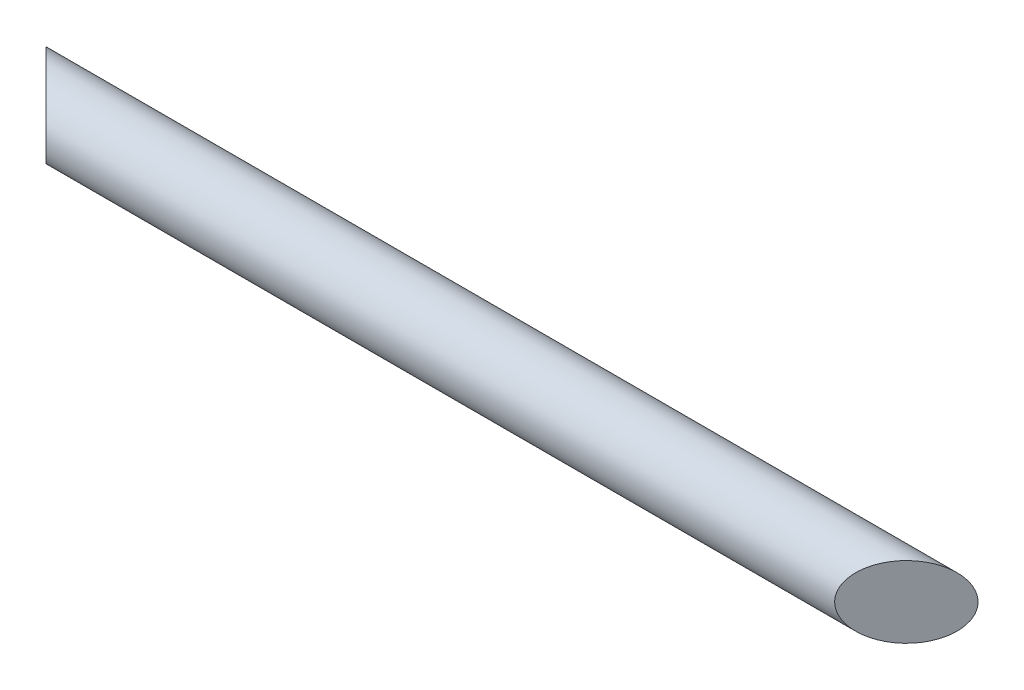
ISO-10303-21;
HEADER;
FILE_DESCRIPTION(('STEP AP214'),'2;1');
FILE_NAME('part.step','',(''),(''),'','','');
FILE_SCHEMA(('AUTOMOTIVE_DESIGN { 1 0 10303 214 1 1 1 1 }'));
ENDSEC;
DATA;
#1=APPLICATION_CONTEXT('core data for automotive mechanical design processes');
#2=APPLICATION_PROTOCOL_DEFINITION('international standard','automotive_design',2000,#1);
#3=PRODUCT_CONTEXT('',#1,'mechanical');
#4=PRODUCT('Part','Part','',(#3));
#5=PRODUCT_RELATED_PRODUCT_CATEGORY('part','',(#4));
#6=PRODUCT_DEFINITION_FORMATION('','',#4);
#7=PRODUCT_DEFINITION_CONTEXT('part definition',#1,'design');
#8=PRODUCT_DEFINITION('design','',#6,#7);
#9=PRODUCT_DEFINITION_SHAPE('','',#8);
#10=(LENGTH_UNIT() NAMED_UNIT(*) SI_UNIT(.MILLI.,.METRE.));
#11=(NAMED_UNIT(*) PLANE_ANGLE_UNIT() SI_UNIT($,.RADIAN.));
#12=(NAMED_UNIT(*) SI_UNIT($,.STERADIAN.) SOLID_ANGLE_UNIT());
#13=UNCERTAINTY_MEASURE_WITH_UNIT(LENGTH_MEASURE(1.E-05),#10,'distance_accuracy_value','');
#14=(GEOMETRIC_REPRESENTATION_CONTEXT(3) GLOBAL_UNCERTAINTY_ASSIGNED_CONTEXT((#13)) GLOBAL_UNIT_ASSIGNED_CONTEXT((#10,
#11,#12)) REPRESENTATION_CONTEXT('',''));
#15=CARTESIAN_POINT('',(0.,0.,0.));
#16=DIRECTION('',(0.,0.,1.));
#17=DIRECTION('',(1.,0.,0.));
#18=AXIS2_PLACEMENT_3D('',#15,#16,#17);
#19=CARTESIAN_POINT('',(698.5,0.,0.));
#20=DIRECTION('',(-1.,0.,0.));
#21=DIRECTION('',(0.,0.,1.));
#22=AXIS2_PLACEMENT_3D('',#19,#20,#21);
#23=CYLINDRICAL_SURFACE('',#22,31.75);
#24=CARTESIAN_POINT('',(-31.7500000000001,0.,0.));
#25=DIRECTION('',(0.707106781186548,0.,-0.707106781186548));
#26=DIRECTION('',(-0.707106781186548,0.,-0.707106781186548));
#27=AXIS2_PLACEMENT_3D('',#24,#25,#26);
#28=ELLIPSE('',#27,44.9012806053458,31.75);
#29=CARTESIAN_POINT('',(-63.5000000000001,0.,-31.75));
#30=VERTEX_POINT('',#29);
#31=EDGE_CURVE('E10',#30,#30,#28,.T.);
#32=ORIENTED_EDGE('',*,*,#31,.T.);
#33=EDGE_LOOP('',(#32));
#34=FACE_BOUND('',#33,.T.);
#35=CARTESIAN_POINT('',(730.25,0.,0.));
#36=DIRECTION('',(0.707106781186548,0.,0.707106781186548));
#37=DIRECTION('',(-0.707106781186548,0.,0.707106781186548));
#38=AXIS2_PLACEMENT_3D('',#35,#36,#37);
#39=ELLIPSE('',#38,44.9012806053458,31.75);
#40=CARTESIAN_POINT('',(698.5,0.,31.75));
#41=VERTEX_POINT('',#40);
#42=EDGE_CURVE('E36',#41,#41,#39,.T.);
#43=ORIENTED_EDGE('',*,*,#42,.F.);
#44=EDGE_LOOP('',(#43));
#45=FACE_BOUND('',#44,.T.);
#46=ADVANCED_FACE('F30',(#34,#45),#23,.T.);
#47=CARTESIAN_POINT('',(365.125,-31.75,365.125));
#48=DIRECTION('',(0.707106781186548,0.,0.707106781186548));
#49=DIRECTION('',(0.707106781186548,0.,-0.707106781186548));
#50=AXIS2_PLACEMENT_3D('',#47,#48,#49);
#51=PLANE('',#50);
#52=ORIENTED_EDGE('',*,*,#42,.T.);
#53=EDGE_LOOP('',(#52));
#54=FACE_BOUND('',#53,.T.);
#55=ADVANCED_FACE('F42',(#54),#51,.T.);
#56=CARTESIAN_POINT('',(-15.875,-31.75,15.875));
#57=DIRECTION('',(0.707106781186548,0.,-0.707106781186548));
#58=DIRECTION('',(-0.707106781186548,0.,-0.707106781186548));
#59=AXIS2_PLACEMENT_3D('',#56,#57,#58);
#60=PLANE('',#59);
#61=ORIENTED_EDGE('',*,*,#31,.F.);
#62=EDGE_LOOP('',(#61));
#63=FACE_BOUND('',#62,.T.);
#64=ADVANCED_FACE('F48',(#63),#60,.F.);
#65=CLOSED_SHELL('',(#46,#55,#64));
#66=MANIFOLD_SOLID_BREP('B2',#65);
#67=ADVANCED_BREP_SHAPE_REPRESENTATION('',(#18,#66),#14);
#68=SHAPE_DEFINITION_REPRESENTATION(#9,#67);
ENDSEC;
END-ISO-10303-21;
